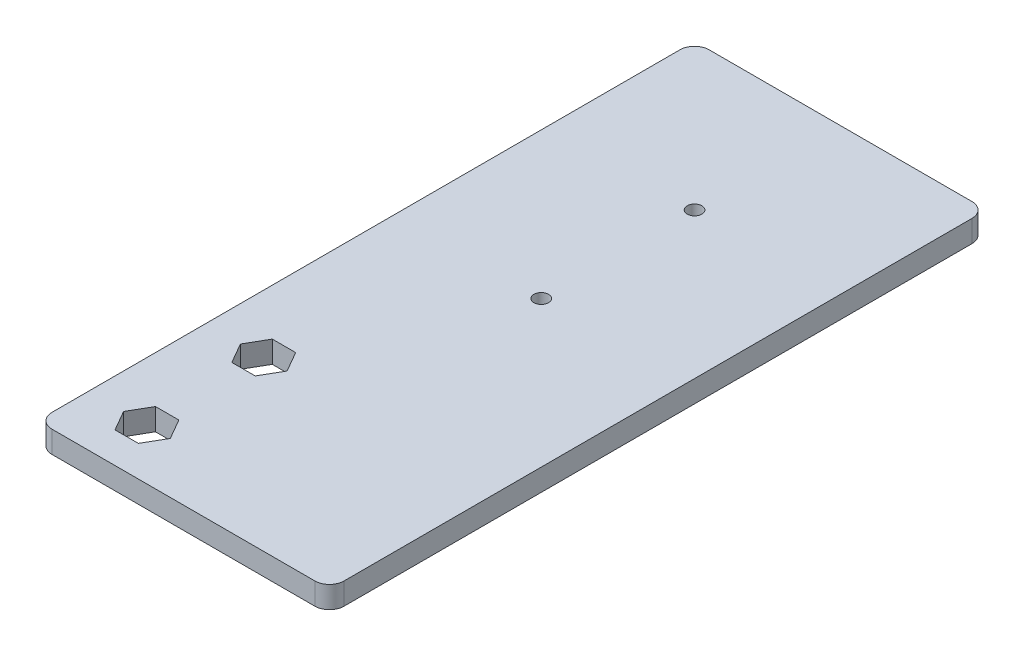
ISO-10303-21;
HEADER;
FILE_DESCRIPTION(('STEP AP214'),'2;1');
FILE_NAME('part.step','',(''),(''),'','','');
FILE_SCHEMA(('AUTOMOTIVE_DESIGN { 1 0 10303 214 1 1 1 1 }'));
ENDSEC;
DATA;
#1=APPLICATION_CONTEXT('core data for automotive mechanical design processes');
#2=APPLICATION_PROTOCOL_DEFINITION('international standard','automotive_design',2000,#1);
#3=PRODUCT_CONTEXT('',#1,'mechanical');
#4=PRODUCT('Part','Part','',(#3));
#5=PRODUCT_RELATED_PRODUCT_CATEGORY('part','',(#4));
#6=PRODUCT_DEFINITION_FORMATION('','',#4);
#7=PRODUCT_DEFINITION_CONTEXT('part definition',#1,'design');
#8=PRODUCT_DEFINITION('design','',#6,#7);
#9=PRODUCT_DEFINITION_SHAPE('','',#8);
#10=(LENGTH_UNIT() NAMED_UNIT(*) SI_UNIT(.MILLI.,.METRE.));
#11=(NAMED_UNIT(*) PLANE_ANGLE_UNIT() SI_UNIT($,.RADIAN.));
#12=(NAMED_UNIT(*) SI_UNIT($,.STERADIAN.) SOLID_ANGLE_UNIT());
#13=UNCERTAINTY_MEASURE_WITH_UNIT(LENGTH_MEASURE(1.E-05),#10,'distance_accuracy_value','');
#14=(GEOMETRIC_REPRESENTATION_CONTEXT(3) GLOBAL_UNCERTAINTY_ASSIGNED_CONTEXT((#13)) GLOBAL_UNIT_ASSIGNED_CONTEXT((#10,
#11,#12)) REPRESENTATION_CONTEXT('',''));
#15=CARTESIAN_POINT('',(0.,0.,0.));
#16=DIRECTION('',(0.,0.,1.));
#17=DIRECTION('',(1.,0.,0.));
#18=AXIS2_PLACEMENT_3D('',#15,#16,#17);
#19=CARTESIAN_POINT('',(51.,3.,-88.));
#20=DIRECTION('',(0.,-1.,0.));
#21=DIRECTION('',(0.,0.,-1.));
#22=AXIS2_PLACEMENT_3D('',#19,#20,#21);
#23=CYLINDRICAL_SURFACE('',#22,2.);
#24=CARTESIAN_POINT('',(51.,0.,-88.));
#25=DIRECTION('',(0.,1.,0.));
#26=DIRECTION('',(0.,0.,-1.));
#27=AXIS2_PLACEMENT_3D('',#24,#25,#26);
#28=CIRCLE('',#27,2.);
#29=CARTESIAN_POINT('',(53.,0.,-88.));
#30=VERTEX_POINT('',#29);
#31=CARTESIAN_POINT('',(51.,0.,-90.));
#32=VERTEX_POINT('',#31);
#33=EDGE_CURVE('E270',#30,#32,#28,.T.);
#34=ORIENTED_EDGE('',*,*,#33,.T.);
#35=DIRECTION('',(0.,-1.,0.));
#36=VECTOR('',#35,1.);
#37=CARTESIAN_POINT('',(51.,3.,-90.));
#38=LINE('',#37,#36);
#39=CARTESIAN_POINT('',(51.,3.,-90.));
#40=VERTEX_POINT('',#39);
#41=EDGE_CURVE('E11',#40,#32,#38,.T.);
#42=ORIENTED_EDGE('',*,*,#41,.F.);
#43=CARTESIAN_POINT('',(51.,3.,-88.));
#44=DIRECTION('',(0.,1.,0.));
#45=DIRECTION('',(0.,0.,-1.));
#46=AXIS2_PLACEMENT_3D('',#43,#44,#45);
#47=CIRCLE('',#46,2.);
#48=CARTESIAN_POINT('',(53.,3.,-88.));
#49=VERTEX_POINT('',#48);
#50=EDGE_CURVE('E280',#49,#40,#47,.T.);
#51=ORIENTED_EDGE('',*,*,#50,.F.);
#52=DIRECTION('',(0.,-1.,0.));
#53=VECTOR('',#52,1.);
#54=CARTESIAN_POINT('',(53.,3.,-88.));
#55=LINE('',#54,#53);
#56=EDGE_CURVE('E298',#49,#30,#55,.T.);
#57=ORIENTED_EDGE('',*,*,#56,.T.);
#58=EDGE_LOOP('',(#34,#42,#51,#57));
#59=FACE_BOUND('',#58,.T.);
#60=ADVANCED_FACE('F32',(#59),#23,.T.);
#61=CARTESIAN_POINT('',(15.,3.,-90.));
#62=DIRECTION('',(0.,0.,1.));
#63=DIRECTION('',(1.,0.,0.));
#64=AXIS2_PLACEMENT_3D('',#61,#62,#63);
#65=PLANE('',#64);
#66=DIRECTION('',(-1.,0.,0.));
#67=VECTOR('',#66,1.);
#68=CARTESIAN_POINT('',(15.,0.,-90.));
#69=LINE('',#68,#67);
#70=CARTESIAN_POINT('',(15.,0.,-90.));
#71=VERTEX_POINT('',#70);
#72=EDGE_CURVE('E301',#32,#71,#69,.T.);
#73=ORIENTED_EDGE('',*,*,#72,.T.);
#74=DIRECTION('',(0.,-1.,0.));
#75=VECTOR('',#74,1.);
#76=CARTESIAN_POINT('',(15.,3.,-90.));
#77=LINE('',#76,#75);
#78=CARTESIAN_POINT('',(15.,3.,-90.));
#79=VERTEX_POINT('',#78);
#80=EDGE_CURVE('E39',#79,#71,#77,.T.);
#81=ORIENTED_EDGE('',*,*,#80,.F.);
#82=DIRECTION('',(-1.,0.,0.));
#83=VECTOR('',#82,1.);
#84=CARTESIAN_POINT('',(15.,3.,-90.));
#85=LINE('',#84,#83);
#86=EDGE_CURVE('E283',#40,#79,#85,.T.);
#87=ORIENTED_EDGE('',*,*,#86,.F.);
#88=ORIENTED_EDGE('',*,*,#41,.T.);
#89=EDGE_LOOP('',(#73,#81,#87,#88));
#90=FACE_BOUND('',#89,.T.);
#91=ADVANCED_FACE('F357',(#90),#65,.F.);
#92=CARTESIAN_POINT('',(15.,3.,-88.));
#93=DIRECTION('',(0.,-1.,0.));
#94=DIRECTION('',(0.,0.,-1.));
#95=AXIS2_PLACEMENT_3D('',#92,#93,#94);
#96=CYLINDRICAL_SURFACE('',#95,2.);
#97=CARTESIAN_POINT('',(15.,0.,-88.));
#98=DIRECTION('',(0.,1.,0.));
#99=DIRECTION('',(0.,0.,1.));
#100=AXIS2_PLACEMENT_3D('',#97,#98,#99);
#101=CIRCLE('',#100,2.);
#102=CARTESIAN_POINT('',(13.,0.,-88.));
#103=VERTEX_POINT('',#102);
#104=EDGE_CURVE('E303',#71,#103,#101,.T.);
#105=ORIENTED_EDGE('',*,*,#104,.T.);
#106=DIRECTION('',(0.,-1.,0.));
#107=VECTOR('',#106,1.);
#108=CARTESIAN_POINT('',(13.,3.,-88.));
#109=LINE('',#108,#107);
#110=CARTESIAN_POINT('',(13.,3.,-88.));
#111=VERTEX_POINT('',#110);
#112=EDGE_CURVE('E328',#111,#103,#109,.T.);
#113=ORIENTED_EDGE('',*,*,#112,.F.);
#114=CARTESIAN_POINT('',(15.,3.,-88.));
#115=DIRECTION('',(0.,1.,0.));
#116=DIRECTION('',(0.,0.,1.));
#117=AXIS2_PLACEMENT_3D('',#114,#115,#116);
#118=CIRCLE('',#117,2.);
#119=EDGE_CURVE('E286',#79,#111,#118,.T.);
#120=ORIENTED_EDGE('',*,*,#119,.F.);
#121=ORIENTED_EDGE('',*,*,#80,.T.);
#122=EDGE_LOOP('',(#105,#113,#120,#121));
#123=FACE_BOUND('',#122,.T.);
#124=ADVANCED_FACE('F335',(#123),#96,.T.);
#125=CARTESIAN_POINT('',(13.,3.,-2.00000000000001));
#126=DIRECTION('',(1.,0.,0.));
#127=DIRECTION('',(0.,0.,-1.));
#128=AXIS2_PLACEMENT_3D('',#125,#126,#127);
#129=PLANE('',#128);
#130=DIRECTION('',(0.,0.,1.));
#131=VECTOR('',#130,1.);
#132=CARTESIAN_POINT('',(13.,0.,-2.00000000000001));
#133=LINE('',#132,#131);
#134=CARTESIAN_POINT('',(13.,0.,-2.00000000000001));
#135=VERTEX_POINT('',#134);
#136=EDGE_CURVE('E305',#103,#135,#133,.T.);
#137=ORIENTED_EDGE('',*,*,#136,.T.);
#138=DIRECTION('',(0.,-1.,0.));
#139=VECTOR('',#138,1.);
#140=CARTESIAN_POINT('',(13.,3.,-2.00000000000001));
#141=LINE('',#140,#139);
#142=CARTESIAN_POINT('',(13.,3.,-2.00000000000001));
#143=VERTEX_POINT('',#142);
#144=EDGE_CURVE('E325',#143,#135,#141,.T.);
#145=ORIENTED_EDGE('',*,*,#144,.F.);
#146=DIRECTION('',(0.,0.,1.));
#147=VECTOR('',#146,1.);
#148=CARTESIAN_POINT('',(13.,3.,-2.00000000000001));
#149=LINE('',#148,#147);
#150=EDGE_CURVE('E288',#111,#143,#149,.T.);
#151=ORIENTED_EDGE('',*,*,#150,.F.);
#152=ORIENTED_EDGE('',*,*,#112,.T.);
#153=EDGE_LOOP('',(#137,#145,#151,#152));
#154=FACE_BOUND('',#153,.T.);
#155=ADVANCED_FACE('F345',(#154),#129,.F.);
#156=CARTESIAN_POINT('',(15.,3.,-2.));
#157=DIRECTION('',(0.,-1.,0.));
#158=DIRECTION('',(0.,0.,-1.));
#159=AXIS2_PLACEMENT_3D('',#156,#157,#158);
#160=CYLINDRICAL_SURFACE('',#159,2.);
#161=CARTESIAN_POINT('',(15.,0.,-2.));
#162=DIRECTION('',(0.,1.,0.));
#163=DIRECTION('',(0.,0.,-1.));
#164=AXIS2_PLACEMENT_3D('',#161,#162,#163);
#165=CIRCLE('',#164,2.);
#166=CARTESIAN_POINT('',(15.,0.,0.));
#167=VERTEX_POINT('',#166);
#168=EDGE_CURVE('E307',#135,#167,#165,.T.);
#169=ORIENTED_EDGE('',*,*,#168,.T.);
#170=DIRECTION('',(0.,-1.,0.));
#171=VECTOR('',#170,1.);
#172=CARTESIAN_POINT('',(15.,3.,0.));
#173=LINE('',#172,#171);
#174=CARTESIAN_POINT('',(15.,3.,0.));
#175=VERTEX_POINT('',#174);
#176=EDGE_CURVE('E322',#175,#167,#173,.T.);
#177=ORIENTED_EDGE('',*,*,#176,.F.);
#178=CARTESIAN_POINT('',(15.,3.,-2.));
#179=DIRECTION('',(0.,1.,0.));
#180=DIRECTION('',(0.,0.,-1.));
#181=AXIS2_PLACEMENT_3D('',#178,#179,#180);
#182=CIRCLE('',#181,2.);
#183=EDGE_CURVE('E290',#143,#175,#182,.T.);
#184=ORIENTED_EDGE('',*,*,#183,.F.);
#185=ORIENTED_EDGE('',*,*,#144,.T.);
#186=EDGE_LOOP('',(#169,#177,#184,#185));
#187=FACE_BOUND('',#186,.T.);
#188=ADVANCED_FACE('F349',(#187),#160,.T.);
#189=CARTESIAN_POINT('',(15.,3.,0.));
#190=DIRECTION('',(0.,0.,-1.));
#191=DIRECTION('',(-1.,0.,0.));
#192=AXIS2_PLACEMENT_3D('',#189,#190,#191);
#193=PLANE('',#192);
#194=DIRECTION('',(1.,0.,0.));
#195=VECTOR('',#194,1.);
#196=CARTESIAN_POINT('',(15.,0.,0.));
#197=LINE('',#196,#195);
#198=CARTESIAN_POINT('',(51.,0.,0.));
#199=VERTEX_POINT('',#198);
#200=EDGE_CURVE('E309',#167,#199,#197,.T.);
#201=ORIENTED_EDGE('',*,*,#200,.T.);
#202=DIRECTION('',(0.,-1.,0.));
#203=VECTOR('',#202,1.);
#204=CARTESIAN_POINT('',(51.,3.,0.));
#205=LINE('',#204,#203);
#206=CARTESIAN_POINT('',(51.,3.,0.));
#207=VERTEX_POINT('',#206);
#208=EDGE_CURVE('E319',#207,#199,#205,.T.);
#209=ORIENTED_EDGE('',*,*,#208,.F.);
#210=DIRECTION('',(1.,0.,0.));
#211=VECTOR('',#210,1.);
#212=CARTESIAN_POINT('',(15.,3.,0.));
#213=LINE('',#212,#211);
#214=EDGE_CURVE('E292',#175,#207,#213,.T.);
#215=ORIENTED_EDGE('',*,*,#214,.F.);
#216=ORIENTED_EDGE('',*,*,#176,.T.);
#217=EDGE_LOOP('',(#201,#209,#215,#216));
#218=FACE_BOUND('',#217,.T.);
#219=ADVANCED_FACE('F370',(#218),#193,.F.);
#220=CARTESIAN_POINT('',(51.,3.,-2.));
#221=DIRECTION('',(0.,-1.,0.));
#222=DIRECTION('',(0.,0.,-1.));
#223=AXIS2_PLACEMENT_3D('',#220,#221,#222);
#224=CYLINDRICAL_SURFACE('',#223,2.);
#225=CARTESIAN_POINT('',(51.,0.,-2.));
#226=DIRECTION('',(0.,1.,0.));
#227=DIRECTION('',(0.,0.,1.));
#228=AXIS2_PLACEMENT_3D('',#225,#226,#227);
#229=CIRCLE('',#228,2.);
#230=CARTESIAN_POINT('',(53.,0.,-2.00000000000001));
#231=VERTEX_POINT('',#230);
#232=EDGE_CURVE('E311',#199,#231,#229,.T.);
#233=ORIENTED_EDGE('',*,*,#232,.T.);
#234=DIRECTION('',(0.,-1.,0.));
#235=VECTOR('',#234,1.);
#236=CARTESIAN_POINT('',(53.,3.,-2.00000000000001));
#237=LINE('',#236,#235);
#238=CARTESIAN_POINT('',(53.,3.,-2.00000000000001));
#239=VERTEX_POINT('',#238);
#240=EDGE_CURVE('E316',#239,#231,#237,.T.);
#241=ORIENTED_EDGE('',*,*,#240,.F.);
#242=CARTESIAN_POINT('',(51.,3.,-2.));
#243=DIRECTION('',(0.,1.,0.));
#244=DIRECTION('',(0.,0.,1.));
#245=AXIS2_PLACEMENT_3D('',#242,#243,#244);
#246=CIRCLE('',#245,2.);
#247=EDGE_CURVE('E294',#207,#239,#246,.T.);
#248=ORIENTED_EDGE('',*,*,#247,.F.);
#249=ORIENTED_EDGE('',*,*,#208,.T.);
#250=EDGE_LOOP('',(#233,#241,#248,#249));
#251=FACE_BOUND('',#250,.T.);
#252=ADVANCED_FACE('F368',(#251),#224,.T.);
#253=CARTESIAN_POINT('',(53.,3.,-88.));
#254=DIRECTION('',(-1.,0.,0.));
#255=DIRECTION('',(0.,0.,1.));
#256=AXIS2_PLACEMENT_3D('',#253,#254,#255);
#257=PLANE('',#256);
#258=DIRECTION('',(0.,0.,-1.));
#259=VECTOR('',#258,1.);
#260=CARTESIAN_POINT('',(53.,0.,-88.));
#261=LINE('',#260,#259);
#262=EDGE_CURVE('E284',#231,#30,#261,.T.);
#263=ORIENTED_EDGE('',*,*,#262,.T.);
#264=ORIENTED_EDGE('',*,*,#56,.F.);
#265=DIRECTION('',(0.,0.,-1.));
#266=VECTOR('',#265,1.);
#267=CARTESIAN_POINT('',(53.,3.,-88.));
#268=LINE('',#267,#266);
#269=EDGE_CURVE('E296',#239,#49,#268,.T.);
#270=ORIENTED_EDGE('',*,*,#269,.F.);
#271=ORIENTED_EDGE('',*,*,#240,.T.);
#272=EDGE_LOOP('',(#263,#264,#270,#271));
#273=FACE_BOUND('',#272,.T.);
#274=ADVANCED_FACE('F363',(#273),#257,.F.);
#275=CARTESIAN_POINT('',(51.,3.,-88.));
#276=DIRECTION('',(0.,-1.,0.));
#277=DIRECTION('',(0.,0.,-1.));
#278=AXIS2_PLACEMENT_3D('',#275,#276,#277);
#279=PLANE('',#278);
#280=DIRECTION('',(0.5,0.,0.866025403784439));
#281=VECTOR('',#280,1.);
#282=CARTESIAN_POINT('',(17.8,3.,-6.99999999999999));
#283=LINE('',#282,#281);
#284=CARTESIAN_POINT('',(17.8,3.,-6.99999999999999));
#285=VERTEX_POINT('',#284);
#286=CARTESIAN_POINT('',(19.4,3.,-4.2287187078898));
#287=VERTEX_POINT('',#286);
#288=EDGE_CURVE('E207',#285,#287,#283,.T.);
#289=ORIENTED_EDGE('',*,*,#288,.F.);
#290=DIRECTION('',(-0.5,0.,0.866025403784439));
#291=VECTOR('',#290,1.);
#292=CARTESIAN_POINT('',(19.4,3.,-9.77128129211019));
#293=LINE('',#292,#291);
#294=CARTESIAN_POINT('',(19.4,3.,-9.77128129211019));
#295=VERTEX_POINT('',#294);
#296=EDGE_CURVE('E46',#295,#285,#293,.T.);
#297=ORIENTED_EDGE('',*,*,#296,.F.);
#298=DIRECTION('',(-1.,0.,0.));
#299=VECTOR('',#298,1.);
#300=CARTESIAN_POINT('',(22.6,3.,-9.77128129211019));
#301=LINE('',#300,#299);
#302=CARTESIAN_POINT('',(22.6,3.,-9.77128129211019));
#303=VERTEX_POINT('',#302);
#304=EDGE_CURVE('E190',#303,#295,#301,.T.);
#305=ORIENTED_EDGE('',*,*,#304,.F.);
#306=DIRECTION('',(-0.5,0.,-0.866025403784439));
#307=VECTOR('',#306,1.);
#308=CARTESIAN_POINT('',(24.2,3.,-6.99999999999999));
#309=LINE('',#308,#307);
#310=CARTESIAN_POINT('',(24.2,3.,-6.99999999999999));
#311=VERTEX_POINT('',#310);
#312=EDGE_CURVE('E193',#311,#303,#309,.T.);
#313=ORIENTED_EDGE('',*,*,#312,.F.);
#314=DIRECTION('',(0.499999999999999,0.,-0.866025403784439));
#315=VECTOR('',#314,1.);
#316=CARTESIAN_POINT('',(22.6,3.,-4.2287187078898));
#317=LINE('',#316,#315);
#318=CARTESIAN_POINT('',(22.6,3.,-4.2287187078898));
#319=VERTEX_POINT('',#318);
#320=EDGE_CURVE('E213',#319,#311,#317,.T.);
#321=ORIENTED_EDGE('',*,*,#320,.F.);
#322=DIRECTION('',(1.,0.,0.));
#323=VECTOR('',#322,1.);
#324=CARTESIAN_POINT('',(19.4,3.,-4.2287187078898));
#325=LINE('',#324,#323);
#326=EDGE_CURVE('E210',#287,#319,#325,.T.);
#327=ORIENTED_EDGE('',*,*,#326,.F.);
#328=EDGE_LOOP('',(#289,#297,#305,#313,#321,#327));
#329=FACE_BOUND('',#328,.T.);
#330=CARTESIAN_POINT('',(33.,3.,-70.));
#331=DIRECTION('',(0.,1.,0.));
#332=DIRECTION('',(0.,0.,1.));
#333=AXIS2_PLACEMENT_3D('',#330,#331,#332);
#334=CIRCLE('',#333,0.999999999999998);
#335=CARTESIAN_POINT('',(33.,3.,-69.));
#336=VERTEX_POINT('',#335);
#337=EDGE_CURVE('E229',#336,#336,#334,.T.);
#338=ORIENTED_EDGE('',*,*,#337,.F.);
#339=EDGE_LOOP('',(#338));
#340=FACE_BOUND('',#339,.T.);
#341=CARTESIAN_POINT('',(33.,3.,-49.));
#342=DIRECTION('',(0.,1.,0.));
#343=DIRECTION('',(0.,0.,1.));
#344=AXIS2_PLACEMENT_3D('',#341,#342,#343);
#345=CIRCLE('',#344,0.999999999999998);
#346=CARTESIAN_POINT('',(33.,3.,-48.));
#347=VERTEX_POINT('',#346);
#348=EDGE_CURVE('E196',#347,#347,#345,.T.);
#349=ORIENTED_EDGE('',*,*,#348,.F.);
#350=EDGE_LOOP('',(#349));
#351=FACE_BOUND('',#350,.T.);
#352=DIRECTION('',(0.500000000000001,0.,0.866025403784438));
#353=VECTOR('',#352,1.);
#354=CARTESIAN_POINT('',(17.8,3.,-23.));
#355=LINE('',#354,#353);
#356=CARTESIAN_POINT('',(17.8,3.,-23.));
#357=VERTEX_POINT('',#356);
#358=CARTESIAN_POINT('',(19.4,3.,-20.2287187078898));
#359=VERTEX_POINT('',#358);
#360=EDGE_CURVE('E254',#357,#359,#355,.T.);
#361=ORIENTED_EDGE('',*,*,#360,.F.);
#362=DIRECTION('',(-0.5,0.,0.866025403784439));
#363=VECTOR('',#362,1.);
#364=CARTESIAN_POINT('',(19.4,3.,-25.7712812921102));
#365=LINE('',#364,#363);
#366=CARTESIAN_POINT('',(19.4,3.,-25.7712812921102));
#367=VERTEX_POINT('',#366);
#368=EDGE_CURVE('E54',#367,#357,#365,.T.);
#369=ORIENTED_EDGE('',*,*,#368,.F.);
#370=DIRECTION('',(-1.,0.,0.));
#371=VECTOR('',#370,1.);
#372=CARTESIAN_POINT('',(22.6,3.,-25.7712812921102));
#373=LINE('',#372,#371);
#374=CARTESIAN_POINT('',(22.6,3.,-25.7712812921102));
#375=VERTEX_POINT('',#374);
#376=EDGE_CURVE('E237',#375,#367,#373,.T.);
#377=ORIENTED_EDGE('',*,*,#376,.F.);
#378=DIRECTION('',(-0.5,0.,-0.866025403784439));
#379=VECTOR('',#378,1.);
#380=CARTESIAN_POINT('',(24.2,3.,-23.));
#381=LINE('',#380,#379);
#382=CARTESIAN_POINT('',(24.2,3.,-23.));
#383=VERTEX_POINT('',#382);
#384=EDGE_CURVE('E263',#383,#375,#381,.T.);
#385=ORIENTED_EDGE('',*,*,#384,.F.);
#386=DIRECTION('',(0.500000000000001,0.,-0.866025403784438));
#387=VECTOR('',#386,1.);
#388=CARTESIAN_POINT('',(22.6,3.,-20.2287187078898));
#389=LINE('',#388,#387);
#390=CARTESIAN_POINT('',(22.6,3.,-20.2287187078898));
#391=VERTEX_POINT('',#390);
#392=EDGE_CURVE('E260',#391,#383,#389,.T.);
#393=ORIENTED_EDGE('',*,*,#392,.F.);
#394=DIRECTION('',(1.,0.,0.));
#395=VECTOR('',#394,1.);
#396=CARTESIAN_POINT('',(19.4,3.,-20.2287187078898));
#397=LINE('',#396,#395);
#398=EDGE_CURVE('E257',#359,#391,#397,.T.);
#399=ORIENTED_EDGE('',*,*,#398,.F.);
#400=EDGE_LOOP('',(#361,#369,#377,#385,#393,#399));
#401=FACE_BOUND('',#400,.T.);
#402=ORIENTED_EDGE('',*,*,#50,.T.);
#403=ORIENTED_EDGE('',*,*,#86,.T.);
#404=ORIENTED_EDGE('',*,*,#119,.T.);
#405=ORIENTED_EDGE('',*,*,#150,.T.);
#406=ORIENTED_EDGE('',*,*,#183,.T.);
#407=ORIENTED_EDGE('',*,*,#214,.T.);
#408=ORIENTED_EDGE('',*,*,#247,.T.);
#409=ORIENTED_EDGE('',*,*,#269,.T.);
#410=EDGE_LOOP('',(#402,#403,#404,#405,#406,#407,#408,#409));
#411=FACE_BOUND('',#410,.T.);
#412=ADVANCED_FACE('F353',(#329,#340,#351,#401,#411),#279,.F.);
#413=CARTESIAN_POINT('',(51.,0.,-88.));
#414=DIRECTION('',(0.,-1.,0.));
#415=DIRECTION('',(0.,0.,-1.));
#416=AXIS2_PLACEMENT_3D('',#413,#414,#415);
#417=PLANE('',#416);
#418=DIRECTION('',(-0.5,0.,0.866025403784439));
#419=VECTOR('',#418,1.);
#420=CARTESIAN_POINT('',(19.4,0.,-9.77128129211019));
#421=LINE('',#420,#419);
#422=CARTESIAN_POINT('',(19.4,0.,-9.77128129211019));
#423=VERTEX_POINT('',#422);
#424=CARTESIAN_POINT('',(17.8,0.,-6.99999999999999));
#425=VERTEX_POINT('',#424);
#426=EDGE_CURVE('E170',#423,#425,#421,.T.);
#427=ORIENTED_EDGE('',*,*,#426,.T.);
#428=DIRECTION('',(0.5,0.,0.866025403784439));
#429=VECTOR('',#428,1.);
#430=CARTESIAN_POINT('',(17.8,0.,-6.99999999999999));
#431=LINE('',#430,#429);
#432=CARTESIAN_POINT('',(19.4,0.,-4.2287187078898));
#433=VERTEX_POINT('',#432);
#434=EDGE_CURVE('E180',#425,#433,#431,.T.);
#435=ORIENTED_EDGE('',*,*,#434,.T.);
#436=DIRECTION('',(1.,0.,0.));
#437=VECTOR('',#436,1.);
#438=CARTESIAN_POINT('',(19.4,0.,-4.2287187078898));
#439=LINE('',#438,#437);
#440=CARTESIAN_POINT('',(22.6,0.,-4.2287187078898));
#441=VERTEX_POINT('',#440);
#442=EDGE_CURVE('E184',#433,#441,#439,.T.);
#443=ORIENTED_EDGE('',*,*,#442,.T.);
#444=DIRECTION('',(0.499999999999999,0.,-0.866025403784439));
#445=VECTOR('',#444,1.);
#446=CARTESIAN_POINT('',(22.6,0.,-4.2287187078898));
#447=LINE('',#446,#445);
#448=CARTESIAN_POINT('',(24.2,0.,-6.99999999999999));
#449=VERTEX_POINT('',#448);
#450=EDGE_CURVE('E200',#441,#449,#447,.T.);
#451=ORIENTED_EDGE('',*,*,#450,.T.);
#452=DIRECTION('',(-0.5,0.,-0.866025403784439));
#453=VECTOR('',#452,1.);
#454=CARTESIAN_POINT('',(24.2,0.,-6.99999999999999));
#455=LINE('',#454,#453);
#456=CARTESIAN_POINT('',(22.6,0.,-9.77128129211019));
#457=VERTEX_POINT('',#456);
#458=EDGE_CURVE('E203',#449,#457,#455,.T.);
#459=ORIENTED_EDGE('',*,*,#458,.T.);
#460=DIRECTION('',(-1.,0.,0.));
#461=VECTOR('',#460,1.);
#462=CARTESIAN_POINT('',(22.6,0.,-9.77128129211019));
#463=LINE('',#462,#461);
#464=EDGE_CURVE('E176',#457,#423,#463,.T.);
#465=ORIENTED_EDGE('',*,*,#464,.T.);
#466=EDGE_LOOP('',(#427,#435,#443,#451,#459,#465));
#467=FACE_BOUND('',#466,.T.);
#468=CARTESIAN_POINT('',(33.,0.,-70.));
#469=DIRECTION('',(0.,1.,0.));
#470=DIRECTION('',(0.,0.,1.));
#471=AXIS2_PLACEMENT_3D('',#468,#469,#470);
#472=CIRCLE('',#471,0.999999999999998);
#473=CARTESIAN_POINT('',(33.,0.,-69.));
#474=VERTEX_POINT('',#473);
#475=EDGE_CURVE('E208',#474,#474,#472,.T.);
#476=ORIENTED_EDGE('',*,*,#475,.T.);
#477=EDGE_LOOP('',(#476));
#478=FACE_BOUND('',#477,.T.);
#479=CARTESIAN_POINT('',(33.,0.,-49.));
#480=DIRECTION('',(0.,1.,0.));
#481=DIRECTION('',(0.,0.,1.));
#482=AXIS2_PLACEMENT_3D('',#479,#480,#481);
#483=CIRCLE('',#482,0.999999999999998);
#484=CARTESIAN_POINT('',(33.,0.,-48.));
#485=VERTEX_POINT('',#484);
#486=EDGE_CURVE('E232',#485,#485,#483,.T.);
#487=ORIENTED_EDGE('',*,*,#486,.T.);
#488=EDGE_LOOP('',(#487));
#489=FACE_BOUND('',#488,.T.);
#490=DIRECTION('',(-0.5,0.,0.866025403784439));
#491=VECTOR('',#490,1.);
#492=CARTESIAN_POINT('',(19.4,0.,-25.7712812921102));
#493=LINE('',#492,#491);
#494=CARTESIAN_POINT('',(19.4,0.,-25.7712812921102));
#495=VERTEX_POINT('',#494);
#496=CARTESIAN_POINT('',(17.8,0.,-23.));
#497=VERTEX_POINT('',#496);
#498=EDGE_CURVE('E233',#495,#497,#493,.T.);
#499=ORIENTED_EDGE('',*,*,#498,.T.);
#500=DIRECTION('',(0.500000000000001,0.,0.866025403784438));
#501=VECTOR('',#500,1.);
#502=CARTESIAN_POINT('',(17.8,0.,-23.));
#503=LINE('',#502,#501);
#504=CARTESIAN_POINT('',(19.4,0.,-20.2287187078898));
#505=VERTEX_POINT('',#504);
#506=EDGE_CURVE('E236',#497,#505,#503,.T.);
#507=ORIENTED_EDGE('',*,*,#506,.T.);
#508=DIRECTION('',(1.,0.,0.));
#509=VECTOR('',#508,1.);
#510=CARTESIAN_POINT('',(19.4,0.,-20.2287187078898));
#511=LINE('',#510,#509);
#512=CARTESIAN_POINT('',(22.6,0.,-20.2287187078898));
#513=VERTEX_POINT('',#512);
#514=EDGE_CURVE('E240',#505,#513,#511,.T.);
#515=ORIENTED_EDGE('',*,*,#514,.T.);
#516=DIRECTION('',(0.500000000000001,0.,-0.866025403784438));
#517=VECTOR('',#516,1.);
#518=CARTESIAN_POINT('',(22.6,0.,-20.2287187078898));
#519=LINE('',#518,#517);
#520=CARTESIAN_POINT('',(24.2,0.,-23.));
#521=VERTEX_POINT('',#520);
#522=EDGE_CURVE('E243',#513,#521,#519,.T.);
#523=ORIENTED_EDGE('',*,*,#522,.T.);
#524=DIRECTION('',(-0.5,0.,-0.866025403784439));
#525=VECTOR('',#524,1.);
#526=CARTESIAN_POINT('',(24.2,0.,-23.));
#527=LINE('',#526,#525);
#528=CARTESIAN_POINT('',(22.6,0.,-25.7712812921102));
#529=VERTEX_POINT('',#528);
#530=EDGE_CURVE('E246',#521,#529,#527,.T.);
#531=ORIENTED_EDGE('',*,*,#530,.T.);
#532=DIRECTION('',(-1.,0.,0.));
#533=VECTOR('',#532,1.);
#534=CARTESIAN_POINT('',(22.6,0.,-25.7712812921102));
#535=LINE('',#534,#533);
#536=EDGE_CURVE('E249',#529,#495,#535,.T.);
#537=ORIENTED_EDGE('',*,*,#536,.T.);
#538=EDGE_LOOP('',(#499,#507,#515,#523,#531,#537));
#539=FACE_BOUND('',#538,.T.);
#540=ORIENTED_EDGE('',*,*,#33,.F.);
#541=ORIENTED_EDGE('',*,*,#262,.F.);
#542=ORIENTED_EDGE('',*,*,#232,.F.);
#543=ORIENTED_EDGE('',*,*,#200,.F.);
#544=ORIENTED_EDGE('',*,*,#168,.F.);
#545=ORIENTED_EDGE('',*,*,#136,.F.);
#546=ORIENTED_EDGE('',*,*,#104,.F.);
#547=ORIENTED_EDGE('',*,*,#72,.F.);
#548=EDGE_LOOP('',(#540,#541,#542,#543,#544,#545,#546,#547));
#549=FACE_BOUND('',#548,.T.);
#550=ADVANCED_FACE('F186',(#467,#478,#489,#539,#549),#417,.T.);
#551=CARTESIAN_POINT('',(19.4,0.,-25.7712812921102));
#552=DIRECTION('',(-0.866025403784439,0.,-0.5));
#553=DIRECTION('',(-0.5,0.,0.866025403784439));
#554=AXIS2_PLACEMENT_3D('',#551,#552,#553);
#555=PLANE('',#554);
#556=ORIENTED_EDGE('',*,*,#368,.T.);
#557=DIRECTION('',(0.,1.,0.));
#558=VECTOR('',#557,1.);
#559=CARTESIAN_POINT('',(17.8,0.,-23.));
#560=LINE('',#559,#558);
#561=EDGE_CURVE('E252',#497,#357,#560,.T.);
#562=ORIENTED_EDGE('',*,*,#561,.F.);
#563=ORIENTED_EDGE('',*,*,#498,.F.);
#564=DIRECTION('',(0.,1.,0.));
#565=VECTOR('',#564,1.);
#566=CARTESIAN_POINT('',(19.4,0.,-25.7712812921102));
#567=LINE('',#566,#565);
#568=EDGE_CURVE('E268',#495,#367,#567,.T.);
#569=ORIENTED_EDGE('',*,*,#568,.T.);
#570=EDGE_LOOP('',(#556,#562,#563,#569));
#571=FACE_BOUND('',#570,.T.);
#572=ADVANCED_FACE('F430',(#571),#555,.F.);
#573=CARTESIAN_POINT('',(22.6,0.,-25.7712812921102));
#574=DIRECTION('',(0.,0.,-1.));
#575=DIRECTION('',(-1.,0.,0.));
#576=AXIS2_PLACEMENT_3D('',#573,#574,#575);
#577=PLANE('',#576);
#578=ORIENTED_EDGE('',*,*,#376,.T.);
#579=ORIENTED_EDGE('',*,*,#568,.F.);
#580=ORIENTED_EDGE('',*,*,#536,.F.);
#581=DIRECTION('',(0.,1.,0.));
#582=VECTOR('',#581,1.);
#583=CARTESIAN_POINT('',(22.6,0.,-25.7712812921102));
#584=LINE('',#583,#582);
#585=EDGE_CURVE('E271',#529,#375,#584,.T.);
#586=ORIENTED_EDGE('',*,*,#585,.T.);
#587=EDGE_LOOP('',(#578,#579,#580,#586));
#588=FACE_BOUND('',#587,.T.);
#589=ADVANCED_FACE('F438',(#588),#577,.F.);
#590=CARTESIAN_POINT('',(24.2,0.,-23.));
#591=DIRECTION('',(0.866025403784439,0.,-0.5));
#592=DIRECTION('',(-0.5,0.,-0.866025403784439));
#593=AXIS2_PLACEMENT_3D('',#590,#591,#592);
#594=PLANE('',#593);
#595=ORIENTED_EDGE('',*,*,#384,.T.);
#596=ORIENTED_EDGE('',*,*,#585,.F.);
#597=ORIENTED_EDGE('',*,*,#530,.F.);
#598=DIRECTION('',(0.,1.,0.));
#599=VECTOR('',#598,1.);
#600=CARTESIAN_POINT('',(24.2,0.,-23.));
#601=LINE('',#600,#599);
#602=EDGE_CURVE('E273',#521,#383,#601,.T.);
#603=ORIENTED_EDGE('',*,*,#602,.T.);
#604=EDGE_LOOP('',(#595,#596,#597,#603));
#605=FACE_BOUND('',#604,.T.);
#606=ADVANCED_FACE('F447',(#605),#594,.F.);
#607=CARTESIAN_POINT('',(22.6,0.,-20.2287187078898));
#608=DIRECTION('',(0.866025403784438,0.,0.500000000000001));
#609=DIRECTION('',(0.500000000000001,0.,-0.866025403784438));
#610=AXIS2_PLACEMENT_3D('',#607,#608,#609);
#611=PLANE('',#610);
#612=ORIENTED_EDGE('',*,*,#392,.T.);
#613=ORIENTED_EDGE('',*,*,#602,.F.);
#614=ORIENTED_EDGE('',*,*,#522,.F.);
#615=DIRECTION('',(0.,1.,0.));
#616=VECTOR('',#615,1.);
#617=CARTESIAN_POINT('',(22.6,0.,-20.2287187078898));
#618=LINE('',#617,#616);
#619=EDGE_CURVE('E275',#513,#391,#618,.T.);
#620=ORIENTED_EDGE('',*,*,#619,.T.);
#621=EDGE_LOOP('',(#612,#613,#614,#620));
#622=FACE_BOUND('',#621,.T.);
#623=ADVANCED_FACE('F457',(#622),#611,.F.);
#624=CARTESIAN_POINT('',(19.4,0.,-20.2287187078898));
#625=DIRECTION('',(0.,0.,1.));
#626=DIRECTION('',(1.,0.,0.));
#627=AXIS2_PLACEMENT_3D('',#624,#625,#626);
#628=PLANE('',#627);
#629=ORIENTED_EDGE('',*,*,#398,.T.);
#630=ORIENTED_EDGE('',*,*,#619,.F.);
#631=ORIENTED_EDGE('',*,*,#514,.F.);
#632=DIRECTION('',(0.,1.,0.));
#633=VECTOR('',#632,1.);
#634=CARTESIAN_POINT('',(19.4,0.,-20.2287187078898));
#635=LINE('',#634,#633);
#636=EDGE_CURVE('E277',#505,#359,#635,.T.);
#637=ORIENTED_EDGE('',*,*,#636,.T.);
#638=EDGE_LOOP('',(#629,#630,#631,#637));
#639=FACE_BOUND('',#638,.T.);
#640=ADVANCED_FACE('F467',(#639),#628,.F.);
#641=CARTESIAN_POINT('',(17.8,0.,-23.));
#642=DIRECTION('',(-0.866025403784438,0.,0.500000000000001));
#643=DIRECTION('',(0.500000000000001,0.,0.866025403784438));
#644=AXIS2_PLACEMENT_3D('',#641,#642,#643);
#645=PLANE('',#644);
#646=ORIENTED_EDGE('',*,*,#360,.T.);
#647=ORIENTED_EDGE('',*,*,#636,.F.);
#648=ORIENTED_EDGE('',*,*,#506,.F.);
#649=ORIENTED_EDGE('',*,*,#561,.T.);
#650=EDGE_LOOP('',(#646,#647,#648,#649));
#651=FACE_BOUND('',#650,.T.);
#652=ADVANCED_FACE('F477',(#651),#645,.F.);
#653=CARTESIAN_POINT('',(33.,0.,-49.));
#654=DIRECTION('',(0.,1.,0.));
#655=DIRECTION('',(0.,0.,1.));
#656=AXIS2_PLACEMENT_3D('',#653,#654,#655);
#657=CYLINDRICAL_SURFACE('',#656,0.999999999999998);
#658=ORIENTED_EDGE('',*,*,#486,.F.);
#659=EDGE_LOOP('',(#658));
#660=FACE_BOUND('',#659,.T.);
#661=ORIENTED_EDGE('',*,*,#348,.T.);
#662=EDGE_LOOP('',(#661));
#663=FACE_BOUND('',#662,.T.);
#664=ADVANCED_FACE('F487',(#660,#663),#657,.F.);
#665=CARTESIAN_POINT('',(33.,0.,-70.));
#666=DIRECTION('',(0.,1.,0.));
#667=DIRECTION('',(0.,0.,1.));
#668=AXIS2_PLACEMENT_3D('',#665,#666,#667);
#669=CYLINDRICAL_SURFACE('',#668,0.999999999999998);
#670=ORIENTED_EDGE('',*,*,#475,.F.);
#671=EDGE_LOOP('',(#670));
#672=FACE_BOUND('',#671,.T.);
#673=ORIENTED_EDGE('',*,*,#337,.T.);
#674=EDGE_LOOP('',(#673));
#675=FACE_BOUND('',#674,.T.);
#676=ADVANCED_FACE('F497',(#672,#675),#669,.F.);
#677=CARTESIAN_POINT('',(19.4,0.,-9.77128129211019));
#678=DIRECTION('',(-0.866025403784439,0.,-0.5));
#679=DIRECTION('',(-0.5,0.,0.866025403784439));
#680=AXIS2_PLACEMENT_3D('',#677,#678,#679);
#681=PLANE('',#680);
#682=ORIENTED_EDGE('',*,*,#296,.T.);
#683=DIRECTION('',(0.,1.,0.));
#684=VECTOR('',#683,1.);
#685=CARTESIAN_POINT('',(17.8,0.,-6.99999999999999));
#686=LINE('',#685,#684);
#687=EDGE_CURVE('E166',#425,#285,#686,.T.);
#688=ORIENTED_EDGE('',*,*,#687,.F.);
#689=ORIENTED_EDGE('',*,*,#426,.F.);
#690=DIRECTION('',(0.,1.,0.));
#691=VECTOR('',#690,1.);
#692=CARTESIAN_POINT('',(19.4,0.,-9.77128129211019));
#693=LINE('',#692,#691);
#694=EDGE_CURVE('E218',#423,#295,#693,.T.);
#695=ORIENTED_EDGE('',*,*,#694,.T.);
#696=EDGE_LOOP('',(#682,#688,#689,#695));
#697=FACE_BOUND('',#696,.T.);
#698=ADVANCED_FACE('F168',(#697),#681,.F.);
#699=CARTESIAN_POINT('',(22.6,0.,-9.77128129211019));
#700=DIRECTION('',(0.,0.,-1.));
#701=DIRECTION('',(-1.,0.,0.));
#702=AXIS2_PLACEMENT_3D('',#699,#700,#701);
#703=PLANE('',#702);
#704=ORIENTED_EDGE('',*,*,#304,.T.);
#705=ORIENTED_EDGE('',*,*,#694,.F.);
#706=ORIENTED_EDGE('',*,*,#464,.F.);
#707=DIRECTION('',(0.,1.,0.));
#708=VECTOR('',#707,1.);
#709=CARTESIAN_POINT('',(22.6,0.,-9.77128129211019));
#710=LINE('',#709,#708);
#711=EDGE_CURVE('E220',#457,#303,#710,.T.);
#712=ORIENTED_EDGE('',*,*,#711,.T.);
#713=EDGE_LOOP('',(#704,#705,#706,#712));
#714=FACE_BOUND('',#713,.T.);
#715=ADVANCED_FACE('F516',(#714),#703,.F.);
#716=CARTESIAN_POINT('',(24.2,0.,-6.99999999999999));
#717=DIRECTION('',(0.866025403784439,0.,-0.5));
#718=DIRECTION('',(-0.5,0.,-0.866025403784439));
#719=AXIS2_PLACEMENT_3D('',#716,#717,#718);
#720=PLANE('',#719);
#721=ORIENTED_EDGE('',*,*,#312,.T.);
#722=ORIENTED_EDGE('',*,*,#711,.F.);
#723=ORIENTED_EDGE('',*,*,#458,.F.);
#724=DIRECTION('',(0.,1.,0.));
#725=VECTOR('',#724,1.);
#726=CARTESIAN_POINT('',(24.2,0.,-6.99999999999999));
#727=LINE('',#726,#725);
#728=EDGE_CURVE('E222',#449,#311,#727,.T.);
#729=ORIENTED_EDGE('',*,*,#728,.T.);
#730=EDGE_LOOP('',(#721,#722,#723,#729));
#731=FACE_BOUND('',#730,.T.);
#732=ADVANCED_FACE('F525',(#731),#720,.F.);
#733=CARTESIAN_POINT('',(22.6,0.,-4.2287187078898));
#734=DIRECTION('',(0.866025403784439,0.,0.499999999999999));
#735=DIRECTION('',(0.499999999999999,0.,-0.866025403784439));
#736=AXIS2_PLACEMENT_3D('',#733,#734,#735);
#737=PLANE('',#736);
#738=ORIENTED_EDGE('',*,*,#320,.T.);
#739=ORIENTED_EDGE('',*,*,#728,.F.);
#740=ORIENTED_EDGE('',*,*,#450,.F.);
#741=DIRECTION('',(0.,1.,0.));
#742=VECTOR('',#741,1.);
#743=CARTESIAN_POINT('',(22.6,0.,-4.2287187078898));
#744=LINE('',#743,#742);
#745=EDGE_CURVE('E224',#441,#319,#744,.T.);
#746=ORIENTED_EDGE('',*,*,#745,.T.);
#747=EDGE_LOOP('',(#738,#739,#740,#746));
#748=FACE_BOUND('',#747,.T.);
#749=ADVANCED_FACE('F535',(#748),#737,.F.);
#750=CARTESIAN_POINT('',(19.4,0.,-4.2287187078898));
#751=DIRECTION('',(0.,0.,1.));
#752=DIRECTION('',(1.,0.,0.));
#753=AXIS2_PLACEMENT_3D('',#750,#751,#752);
#754=PLANE('',#753);
#755=ORIENTED_EDGE('',*,*,#326,.T.);
#756=ORIENTED_EDGE('',*,*,#745,.F.);
#757=ORIENTED_EDGE('',*,*,#442,.F.);
#758=DIRECTION('',(0.,1.,0.));
#759=VECTOR('',#758,1.);
#760=CARTESIAN_POINT('',(19.4,0.,-4.2287187078898));
#761=LINE('',#760,#759);
#762=EDGE_CURVE('E175',#433,#287,#761,.T.);
#763=ORIENTED_EDGE('',*,*,#762,.T.);
#764=EDGE_LOOP('',(#755,#756,#757,#763));
#765=FACE_BOUND('',#764,.T.);
#766=ADVANCED_FACE('F545',(#765),#754,.F.);
#767=CARTESIAN_POINT('',(17.8,0.,-6.99999999999999));
#768=DIRECTION('',(-0.866025403784439,0.,0.5));
#769=DIRECTION('',(0.5,0.,0.866025403784439));
#770=AXIS2_PLACEMENT_3D('',#767,#768,#769);
#771=PLANE('',#770);
#772=ORIENTED_EDGE('',*,*,#288,.T.);
#773=ORIENTED_EDGE('',*,*,#762,.F.);
#774=ORIENTED_EDGE('',*,*,#434,.F.);
#775=ORIENTED_EDGE('',*,*,#687,.T.);
#776=EDGE_LOOP('',(#772,#773,#774,#775));
#777=FACE_BOUND('',#776,.T.);
#778=ADVANCED_FACE('F181',(#777),#771,.F.);
#779=CLOSED_SHELL('',(#60,#91,#124,#155,#188,#219,#252,#274,#412,#550,#572,#589,#606,#623,#640,
#652,#664,#676,#698,#715,#732,#749,#766,#778));
#780=MANIFOLD_SOLID_BREP('B2',#779);
#781=ADVANCED_BREP_SHAPE_REPRESENTATION('',(#18,#780),#14);
#782=SHAPE_DEFINITION_REPRESENTATION(#9,#781);
ENDSEC;
END-ISO-10303-21;
